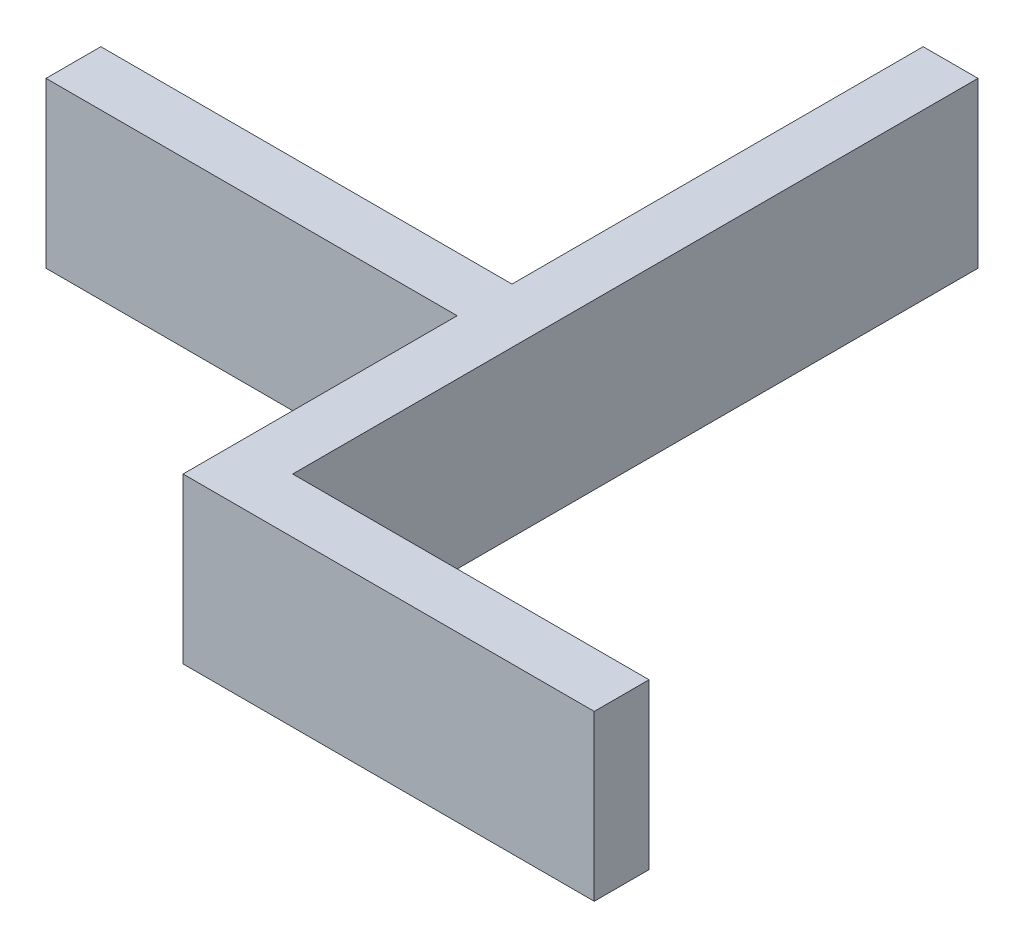
ISO-10303-21;
HEADER;
FILE_DESCRIPTION(('STEP AP214'),'2;1');
FILE_NAME('part.step','',(''),(''),'','','');
FILE_SCHEMA(('AUTOMOTIVE_DESIGN { 1 0 10303 214 1 1 1 1 }'));
ENDSEC;
DATA;
#1=APPLICATION_CONTEXT('core data for automotive mechanical design processes');
#2=APPLICATION_PROTOCOL_DEFINITION('international standard','automotive_design',2000,#1);
#3=PRODUCT_CONTEXT('',#1,'mechanical');
#4=PRODUCT('Part','Part','',(#3));
#5=PRODUCT_RELATED_PRODUCT_CATEGORY('part','',(#4));
#6=PRODUCT_DEFINITION_FORMATION('','',#4);
#7=PRODUCT_DEFINITION_CONTEXT('part definition',#1,'design');
#8=PRODUCT_DEFINITION('design','',#6,#7);
#9=PRODUCT_DEFINITION_SHAPE('','',#8);
#10=(LENGTH_UNIT() NAMED_UNIT(*) SI_UNIT(.MILLI.,.METRE.));
#11=(NAMED_UNIT(*) PLANE_ANGLE_UNIT() SI_UNIT($,.RADIAN.));
#12=(NAMED_UNIT(*) SI_UNIT($,.STERADIAN.) SOLID_ANGLE_UNIT());
#13=UNCERTAINTY_MEASURE_WITH_UNIT(LENGTH_MEASURE(1.E-05),#10,'distance_accuracy_value','');
#14=(GEOMETRIC_REPRESENTATION_CONTEXT(3) GLOBAL_UNCERTAINTY_ASSIGNED_CONTEXT((#13)) GLOBAL_UNIT_ASSIGNED_CONTEXT((#10,
#11,#12)) REPRESENTATION_CONTEXT('',''));
#15=CARTESIAN_POINT('',(0.,0.,0.));
#16=DIRECTION('',(0.,0.,1.));
#17=DIRECTION('',(1.,0.,0.));
#18=AXIS2_PLACEMENT_3D('',#15,#16,#17);
#19=CARTESIAN_POINT('',(0.,0.,0.));
#20=DIRECTION('',(1.,0.,0.));
#21=DIRECTION('',(0.,0.,-1.));
#22=AXIS2_PLACEMENT_3D('',#19,#20,#21);
#23=PLANE('',#22);
#24=DIRECTION('',(0.,-1.,0.));
#25=VECTOR('',#24,1.);
#26=CARTESIAN_POINT('',(0.,0.,17.7783993105183));
#27=LINE('',#26,#25);
#28=CARTESIAN_POINT('',(0.,-25.7573435684958,17.7783993105183));
#29=VERTEX_POINT('',#28);
#30=CARTESIAN_POINT('',(0.,-31.7573435684958,17.7783993105183));
#31=VERTEX_POINT('',#30);
#32=EDGE_CURVE('E151',#29,#31,#27,.T.);
#33=ORIENTED_EDGE('',*,*,#32,.F.);
#34=DIRECTION('',(0.,0.,-1.));
#35=VECTOR('',#34,1.);
#36=CARTESIAN_POINT('',(0.,-25.7573435684958,0.));
#37=LINE('',#36,#35);
#38=CARTESIAN_POINT('',(0.,-25.7573435684958,2.77839931051833));
#39=VERTEX_POINT('',#38);
#40=EDGE_CURVE('E79',#29,#39,#37,.T.);
#41=ORIENTED_EDGE('',*,*,#40,.T.);
#42=DIRECTION('',(0.,-1.,0.));
#43=VECTOR('',#42,1.);
#44=CARTESIAN_POINT('',(0.,0.,2.77839931051833));
#45=LINE('',#44,#43);
#46=CARTESIAN_POINT('',(0.,-31.7573435684958,2.77839931051833));
#47=VERTEX_POINT('',#46);
#48=EDGE_CURVE('E178',#39,#47,#45,.T.);
#49=ORIENTED_EDGE('',*,*,#48,.T.);
#50=DIRECTION('',(0.,0.,-1.));
#51=VECTOR('',#50,1.);
#52=CARTESIAN_POINT('',(0.,-31.7573435684958,0.));
#53=LINE('',#52,#51);
#54=EDGE_CURVE('E197',#31,#47,#53,.T.);
#55=ORIENTED_EDGE('',*,*,#54,.F.);
#56=EDGE_LOOP('',(#33,#41,#49,#55));
#57=FACE_BOUND('',#56,.T.);
#58=ADVANCED_FACE('F37',(#57),#23,.F.);
#59=CARTESIAN_POINT('',(2.,-31.7573435684958,0.));
#60=DIRECTION('',(0.,1.,0.));
#61=DIRECTION('',(0.,0.,1.));
#62=AXIS2_PLACEMENT_3D('',#59,#60,#61);
#63=PLANE('',#62);
#64=CARTESIAN_POINT('',(0.,-31.7573435684958,29.7783993105183));
#65=VERTEX_POINT('',#64);
#66=CARTESIAN_POINT('',(0.,-31.7573435684958,19.7783993105183));
#67=VERTEX_POINT('',#66);
#68=EDGE_CURVE('E199',#65,#67,#53,.T.);
#69=ORIENTED_EDGE('',*,*,#68,.T.);
#70=DIRECTION('',(1.,0.,0.));
#71=VECTOR('',#70,1.);
#72=CARTESIAN_POINT('',(-15.,-31.7573435684958,19.7783993105183));
#73=LINE('',#72,#71);
#74=CARTESIAN_POINT('',(-15.,-31.7573435684958,19.7783993105183));
#75=VERTEX_POINT('',#74);
#76=EDGE_CURVE('E54',#75,#67,#73,.T.);
#77=ORIENTED_EDGE('',*,*,#76,.F.);
#78=DIRECTION('',(0.,0.,-1.));
#79=VECTOR('',#78,1.);
#80=CARTESIAN_POINT('',(-15.,-31.7573435684958,0.));
#81=LINE('',#80,#79);
#82=CARTESIAN_POINT('',(-15.,-31.7573435684958,17.7783993105183));
#83=VERTEX_POINT('',#82);
#84=EDGE_CURVE('E144',#75,#83,#81,.T.);
#85=ORIENTED_EDGE('',*,*,#84,.T.);
#86=DIRECTION('',(1.,0.,0.));
#87=VECTOR('',#86,1.);
#88=CARTESIAN_POINT('',(-15.,-31.7573435684958,17.7783993105183));
#89=LINE('',#88,#87);
#90=EDGE_CURVE('E147',#83,#31,#89,.T.);
#91=ORIENTED_EDGE('',*,*,#90,.T.);
#92=ORIENTED_EDGE('',*,*,#54,.T.);
#93=DIRECTION('',(-1.,0.,0.));
#94=VECTOR('',#93,1.);
#95=CARTESIAN_POINT('',(2.,-31.7573435684958,2.77839931051833));
#96=LINE('',#95,#94);
#97=CARTESIAN_POINT('',(2.,-31.7573435684958,2.77839931051833));
#98=VERTEX_POINT('',#97);
#99=EDGE_CURVE('E11',#98,#47,#96,.T.);
#100=ORIENTED_EDGE('',*,*,#99,.F.);
#101=DIRECTION('',(0.,0.,-1.));
#102=VECTOR('',#101,1.);
#103=CARTESIAN_POINT('',(2.,-31.7573435684958,0.));
#104=LINE('',#103,#102);
#105=CARTESIAN_POINT('',(2.,-31.7573435684958,27.7783993105183));
#106=VERTEX_POINT('',#105);
#107=EDGE_CURVE('E85',#106,#98,#104,.T.);
#108=ORIENTED_EDGE('',*,*,#107,.F.);
#109=DIRECTION('',(-1.,0.,0.));
#110=VECTOR('',#109,1.);
#111=CARTESIAN_POINT('',(15.,-31.7573435684958,27.7783993105183));
#112=LINE('',#111,#110);
#113=CARTESIAN_POINT('',(15.,-31.7573435684958,27.7783993105183));
#114=VERTEX_POINT('',#113);
#115=EDGE_CURVE('E63',#114,#106,#112,.T.);
#116=ORIENTED_EDGE('',*,*,#115,.F.);
#117=DIRECTION('',(0.,0.,-1.));
#118=VECTOR('',#117,1.);
#119=CARTESIAN_POINT('',(15.,-31.7573435684958,0.));
#120=LINE('',#119,#118);
#121=CARTESIAN_POINT('',(15.,-31.7573435684958,29.7783993105183));
#122=VERTEX_POINT('',#121);
#123=EDGE_CURVE('E398',#122,#114,#120,.T.);
#124=ORIENTED_EDGE('',*,*,#123,.F.);
#125=DIRECTION('',(-1.,0.,0.));
#126=VECTOR('',#125,1.);
#127=CARTESIAN_POINT('',(15.,-31.7573435684958,29.7783993105183));
#128=LINE('',#127,#126);
#129=EDGE_CURVE('E234',#122,#65,#128,.T.);
#130=ORIENTED_EDGE('',*,*,#129,.T.);
#131=EDGE_LOOP('',(#69,#77,#85,#91,#92,#100,#108,#116,#124,#130));
#132=FACE_BOUND('',#131,.T.);
#133=ADVANCED_FACE('F39',(#132),#63,.F.);
#134=CARTESIAN_POINT('',(2.,0.,2.77839931051833));
#135=DIRECTION('',(0.,0.,-1.));
#136=DIRECTION('',(-1.,0.,0.));
#137=AXIS2_PLACEMENT_3D('',#134,#135,#136);
#138=PLANE('',#137);
#139=ORIENTED_EDGE('',*,*,#48,.F.);
#140=DIRECTION('',(-1.,0.,0.));
#141=VECTOR('',#140,1.);
#142=CARTESIAN_POINT('',(2.,-25.7573435684958,2.77839931051833));
#143=LINE('',#142,#141);
#144=CARTESIAN_POINT('',(2.,-25.7573435684958,2.77839931051833));
#145=VERTEX_POINT('',#144);
#146=EDGE_CURVE('E46',#145,#39,#143,.T.);
#147=ORIENTED_EDGE('',*,*,#146,.F.);
#148=DIRECTION('',(0.,-1.,0.));
#149=VECTOR('',#148,1.);
#150=CARTESIAN_POINT('',(2.,0.,2.77839931051833));
#151=LINE('',#150,#149);
#152=EDGE_CURVE('E193',#145,#98,#151,.T.);
#153=ORIENTED_EDGE('',*,*,#152,.T.);
#154=ORIENTED_EDGE('',*,*,#99,.T.);
#155=EDGE_LOOP('',(#139,#147,#153,#154));
#156=FACE_BOUND('',#155,.T.);
#157=ADVANCED_FACE('F238',(#156),#138,.T.);
#158=CARTESIAN_POINT('',(2.,-25.7573435684958,0.));
#159=DIRECTION('',(0.,1.,0.));
#160=DIRECTION('',(0.,0.,1.));
#161=AXIS2_PLACEMENT_3D('',#158,#159,#160);
#162=PLANE('',#161);
#163=CARTESIAN_POINT('',(0.,-25.7573435684958,29.7783993105183));
#164=VERTEX_POINT('',#163);
#165=CARTESIAN_POINT('',(0.,-25.7573435684958,19.7783993105183));
#166=VERTEX_POINT('',#165);
#167=EDGE_CURVE('E177',#164,#166,#37,.T.);
#168=ORIENTED_EDGE('',*,*,#167,.F.);
#169=DIRECTION('',(-1.,0.,0.));
#170=VECTOR('',#169,1.);
#171=CARTESIAN_POINT('',(15.,-25.7573435684958,29.7783993105183));
#172=LINE('',#171,#170);
#173=CARTESIAN_POINT('',(15.,-25.7573435684958,29.7783993105183));
#174=VERTEX_POINT('',#173);
#175=EDGE_CURVE('E216',#174,#164,#172,.T.);
#176=ORIENTED_EDGE('',*,*,#175,.F.);
#177=DIRECTION('',(0.,0.,-1.));
#178=VECTOR('',#177,1.);
#179=CARTESIAN_POINT('',(15.,-25.7573435684958,0.));
#180=LINE('',#179,#178);
#181=CARTESIAN_POINT('',(15.,-25.7573435684958,27.7783993105183));
#182=VERTEX_POINT('',#181);
#183=EDGE_CURVE('E224',#174,#182,#180,.T.);
#184=ORIENTED_EDGE('',*,*,#183,.T.);
#185=DIRECTION('',(-1.,0.,0.));
#186=VECTOR('',#185,1.);
#187=CARTESIAN_POINT('',(15.,-25.7573435684958,27.7783993105183));
#188=LINE('',#187,#186);
#189=CARTESIAN_POINT('',(2.,-25.7573435684958,27.7783993105183));
#190=VERTEX_POINT('',#189);
#191=EDGE_CURVE('E223',#182,#190,#188,.T.);
#192=ORIENTED_EDGE('',*,*,#191,.T.);
#193=DIRECTION('',(0.,0.,-1.));
#194=VECTOR('',#193,1.);
#195=CARTESIAN_POINT('',(2.,-25.7573435684958,0.));
#196=LINE('',#195,#194);
#197=EDGE_CURVE('E189',#190,#145,#196,.T.);
#198=ORIENTED_EDGE('',*,*,#197,.T.);
#199=ORIENTED_EDGE('',*,*,#146,.T.);
#200=ORIENTED_EDGE('',*,*,#40,.F.);
#201=DIRECTION('',(1.,0.,0.));
#202=VECTOR('',#201,1.);
#203=CARTESIAN_POINT('',(-15.,-25.7573435684958,17.7783993105183));
#204=LINE('',#203,#202);
#205=CARTESIAN_POINT('',(-15.,-25.7573435684958,17.7783993105183));
#206=VERTEX_POINT('',#205);
#207=EDGE_CURVE('E139',#206,#29,#204,.T.);
#208=ORIENTED_EDGE('',*,*,#207,.F.);
#209=DIRECTION('',(0.,0.,-1.));
#210=VECTOR('',#209,1.);
#211=CARTESIAN_POINT('',(-15.,-25.7573435684958,0.));
#212=LINE('',#211,#210);
#213=CARTESIAN_POINT('',(-15.,-25.7573435684958,19.7783993105183));
#214=VERTEX_POINT('',#213);
#215=EDGE_CURVE('E129',#214,#206,#212,.T.);
#216=ORIENTED_EDGE('',*,*,#215,.F.);
#217=DIRECTION('',(1.,0.,0.));
#218=VECTOR('',#217,1.);
#219=CARTESIAN_POINT('',(-15.,-25.7573435684958,19.7783993105183));
#220=LINE('',#219,#218);
#221=EDGE_CURVE('E143',#214,#166,#220,.T.);
#222=ORIENTED_EDGE('',*,*,#221,.T.);
#223=EDGE_LOOP('',(#168,#176,#184,#192,#198,#199,#200,#208,#216,#222));
#224=FACE_BOUND('',#223,.T.);
#225=ADVANCED_FACE('F140',(#224),#162,.T.);
#226=CARTESIAN_POINT('',(2.,0.,0.));
#227=DIRECTION('',(1.,0.,0.));
#228=DIRECTION('',(0.,0.,-1.));
#229=AXIS2_PLACEMENT_3D('',#226,#227,#228);
#230=PLANE('',#229);
#231=ORIENTED_EDGE('',*,*,#107,.T.);
#232=ORIENTED_EDGE('',*,*,#152,.F.);
#233=ORIENTED_EDGE('',*,*,#197,.F.);
#234=DIRECTION('',(0.,-1.,0.));
#235=VECTOR('',#234,1.);
#236=CARTESIAN_POINT('',(2.,0.,27.7783993105183));
#237=LINE('',#236,#235);
#238=EDGE_CURVE('E185',#190,#106,#237,.T.);
#239=ORIENTED_EDGE('',*,*,#238,.T.);
#240=EDGE_LOOP('',(#231,#232,#233,#239));
#241=FACE_BOUND('',#240,.T.);
#242=ADVANCED_FACE('F248',(#241),#230,.T.);
#243=ORIENTED_EDGE('',*,*,#167,.T.);
#244=DIRECTION('',(0.,-1.,0.));
#245=VECTOR('',#244,1.);
#246=CARTESIAN_POINT('',(0.,0.,19.7783993105183));
#247=LINE('',#246,#245);
#248=EDGE_CURVE('E149',#166,#67,#247,.T.);
#249=ORIENTED_EDGE('',*,*,#248,.T.);
#250=ORIENTED_EDGE('',*,*,#68,.F.);
#251=DIRECTION('',(0.,-1.,0.));
#252=VECTOR('',#251,1.);
#253=CARTESIAN_POINT('',(0.,0.,29.7783993105183));
#254=LINE('',#253,#252);
#255=EDGE_CURVE('E163',#164,#65,#254,.T.);
#256=ORIENTED_EDGE('',*,*,#255,.F.);
#257=EDGE_LOOP('',(#243,#249,#250,#256));
#258=FACE_BOUND('',#257,.T.);
#259=ADVANCED_FACE('F213',(#258),#23,.F.);
#260=CARTESIAN_POINT('',(15.,0.,27.7783993105183));
#261=DIRECTION('',(0.,0.,-1.));
#262=DIRECTION('',(-1.,0.,0.));
#263=AXIS2_PLACEMENT_3D('',#260,#261,#262);
#264=PLANE('',#263);
#265=ORIENTED_EDGE('',*,*,#238,.F.);
#266=ORIENTED_EDGE('',*,*,#191,.F.);
#267=DIRECTION('',(0.,-1.,0.));
#268=VECTOR('',#267,1.);
#269=CARTESIAN_POINT('',(15.,0.,27.7783993105183));
#270=LINE('',#269,#268);
#271=EDGE_CURVE('E227',#182,#114,#270,.T.);
#272=ORIENTED_EDGE('',*,*,#271,.T.);
#273=ORIENTED_EDGE('',*,*,#115,.T.);
#274=EDGE_LOOP('',(#265,#266,#272,#273));
#275=FACE_BOUND('',#274,.T.);
#276=ADVANCED_FACE('F247',(#275),#264,.T.);
#277=CARTESIAN_POINT('',(15.,0.,29.7783993105183));
#278=DIRECTION('',(0.,0.,-1.));
#279=DIRECTION('',(-1.,0.,0.));
#280=AXIS2_PLACEMENT_3D('',#277,#278,#279);
#281=PLANE('',#280);
#282=ORIENTED_EDGE('',*,*,#255,.T.);
#283=ORIENTED_EDGE('',*,*,#129,.F.);
#284=DIRECTION('',(0.,-1.,0.));
#285=VECTOR('',#284,1.);
#286=CARTESIAN_POINT('',(15.,0.,29.7783993105183));
#287=LINE('',#286,#285);
#288=EDGE_CURVE('E166',#174,#122,#287,.T.);
#289=ORIENTED_EDGE('',*,*,#288,.F.);
#290=ORIENTED_EDGE('',*,*,#175,.T.);
#291=EDGE_LOOP('',(#282,#283,#289,#290));
#292=FACE_BOUND('',#291,.T.);
#293=ADVANCED_FACE('F219',(#292),#281,.F.);
#294=CARTESIAN_POINT('',(15.,0.,0.));
#295=DIRECTION('',(1.,0.,0.));
#296=DIRECTION('',(0.,0.,-1.));
#297=AXIS2_PLACEMENT_3D('',#294,#295,#296);
#298=PLANE('',#297);
#299=ORIENTED_EDGE('',*,*,#288,.T.);
#300=ORIENTED_EDGE('',*,*,#123,.T.);
#301=ORIENTED_EDGE('',*,*,#271,.F.);
#302=ORIENTED_EDGE('',*,*,#183,.F.);
#303=EDGE_LOOP('',(#299,#300,#301,#302));
#304=FACE_BOUND('',#303,.T.);
#305=ADVANCED_FACE('F259',(#304),#298,.T.);
#306=CARTESIAN_POINT('',(-15.,0.,17.7783993105183));
#307=DIRECTION('',(0.,0.,1.));
#308=DIRECTION('',(1.,0.,0.));
#309=AXIS2_PLACEMENT_3D('',#306,#307,#308);
#310=PLANE('',#309);
#311=ORIENTED_EDGE('',*,*,#32,.T.);
#312=ORIENTED_EDGE('',*,*,#90,.F.);
#313=DIRECTION('',(0.,-1.,0.));
#314=VECTOR('',#313,1.);
#315=CARTESIAN_POINT('',(-15.,0.,17.7783993105183));
#316=LINE('',#315,#314);
#317=EDGE_CURVE('E134',#206,#83,#316,.T.);
#318=ORIENTED_EDGE('',*,*,#317,.F.);
#319=ORIENTED_EDGE('',*,*,#207,.T.);
#320=EDGE_LOOP('',(#311,#312,#318,#319));
#321=FACE_BOUND('',#320,.T.);
#322=ADVANCED_FACE('F146',(#321),#310,.F.);
#323=CARTESIAN_POINT('',(-15.,0.,19.7783993105183));
#324=DIRECTION('',(0.,0.,1.));
#325=DIRECTION('',(1.,0.,0.));
#326=AXIS2_PLACEMENT_3D('',#323,#324,#325);
#327=PLANE('',#326);
#328=ORIENTED_EDGE('',*,*,#248,.F.);
#329=ORIENTED_EDGE('',*,*,#221,.F.);
#330=DIRECTION('',(0.,-1.,0.));
#331=VECTOR('',#330,1.);
#332=CARTESIAN_POINT('',(-15.,0.,19.7783993105183));
#333=LINE('',#332,#331);
#334=EDGE_CURVE('E136',#214,#75,#333,.T.);
#335=ORIENTED_EDGE('',*,*,#334,.T.);
#336=ORIENTED_EDGE('',*,*,#76,.T.);
#337=EDGE_LOOP('',(#328,#329,#335,#336));
#338=FACE_BOUND('',#337,.T.);
#339=ADVANCED_FACE('F266',(#338),#327,.T.);
#340=CARTESIAN_POINT('',(-15.,0.,0.));
#341=DIRECTION('',(1.,0.,0.));
#342=DIRECTION('',(0.,0.,-1.));
#343=AXIS2_PLACEMENT_3D('',#340,#341,#342);
#344=PLANE('',#343);
#345=ORIENTED_EDGE('',*,*,#317,.T.);
#346=ORIENTED_EDGE('',*,*,#84,.F.);
#347=ORIENTED_EDGE('',*,*,#334,.F.);
#348=ORIENTED_EDGE('',*,*,#215,.T.);
#349=EDGE_LOOP('',(#345,#346,#347,#348));
#350=FACE_BOUND('',#349,.T.);
#351=ADVANCED_FACE('F131',(#350),#344,.F.);
#352=CLOSED_SHELL('',(#58,#133,#157,#225,#242,#259,#276,#293,#305,#322,#339,#351));
#353=MANIFOLD_SOLID_BREP('B2',#352);
#354=ADVANCED_BREP_SHAPE_REPRESENTATION('',(#18,#353),#14);
#355=SHAPE_DEFINITION_REPRESENTATION(#9,#354);
ENDSEC;
END-ISO-10303-21;
